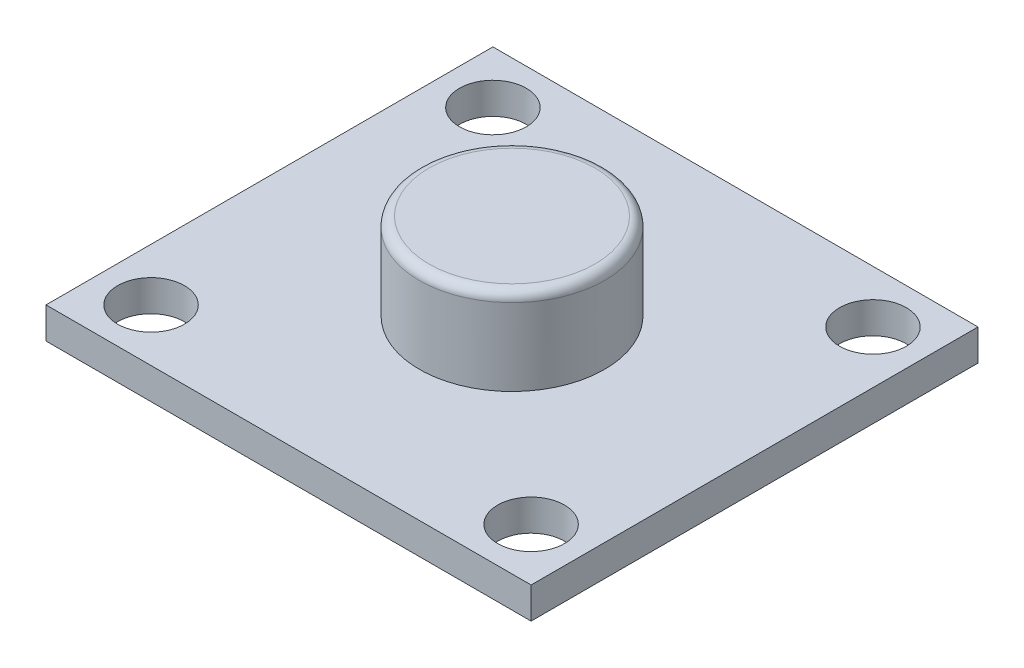
ISO-10303-21;
HEADER;
FILE_DESCRIPTION(('STEP AP214'),'2;1');
FILE_NAME('part.step','',(''),(''),'','','');
FILE_SCHEMA(('AUTOMOTIVE_DESIGN { 1 0 10303 214 1 1 1 1 }'));
ENDSEC;
DATA;
#1=APPLICATION_CONTEXT('core data for automotive mechanical design processes');
#2=APPLICATION_PROTOCOL_DEFINITION('international standard','automotive_design',2000,#1);
#3=PRODUCT_CONTEXT('',#1,'mechanical');
#4=PRODUCT('Part','Part','',(#3));
#5=PRODUCT_RELATED_PRODUCT_CATEGORY('part','',(#4));
#6=PRODUCT_DEFINITION_FORMATION('','',#4);
#7=PRODUCT_DEFINITION_CONTEXT('part definition',#1,'design');
#8=PRODUCT_DEFINITION('design','',#6,#7);
#9=PRODUCT_DEFINITION_SHAPE('','',#8);
#10=(LENGTH_UNIT() NAMED_UNIT(*) SI_UNIT(.MILLI.,.METRE.));
#11=(NAMED_UNIT(*) PLANE_ANGLE_UNIT() SI_UNIT($,.RADIAN.));
#12=(NAMED_UNIT(*) SI_UNIT($,.STERADIAN.) SOLID_ANGLE_UNIT());
#13=UNCERTAINTY_MEASURE_WITH_UNIT(LENGTH_MEASURE(1.E-05),#10,'distance_accuracy_value','');
#14=(GEOMETRIC_REPRESENTATION_CONTEXT(3) GLOBAL_UNCERTAINTY_ASSIGNED_CONTEXT((#13)) GLOBAL_UNIT_ASSIGNED_CONTEXT((#10,
#11,#12)) REPRESENTATION_CONTEXT('',''));
#15=CARTESIAN_POINT('',(0.,0.,0.));
#16=DIRECTION('',(0.,0.,1.));
#17=DIRECTION('',(1.,0.,0.));
#18=AXIS2_PLACEMENT_3D('',#15,#16,#17);
#19=CARTESIAN_POINT('',(0.,5.67,0.));
#20=DIRECTION('',(0.,1.,0.));
#21=DIRECTION('',(0.,0.,1.));
#22=AXIS2_PLACEMENT_3D('',#19,#20,#21);
#23=TOROIDAL_SURFACE('',#22,4.35,0.5);
#24=CARTESIAN_POINT('',(0.,6.17,0.));
#25=DIRECTION('',(0.,1.,0.));
#26=DIRECTION('',(0.,0.,1.));
#27=AXIS2_PLACEMENT_3D('',#24,#25,#26);
#28=CIRCLE('',#27,4.35);
#29=CARTESIAN_POINT('',(0.,6.17,4.35));
#30=VERTEX_POINT('',#29);
#31=EDGE_CURVE('E58',#30,#30,#28,.T.);
#32=ORIENTED_EDGE('',*,*,#31,.F.);
#33=EDGE_LOOP('',(#32));
#34=FACE_BOUND('',#33,.T.);
#35=CARTESIAN_POINT('',(0.,5.67,0.));
#36=DIRECTION('',(0.,1.,0.));
#37=DIRECTION('',(0.,0.,1.));
#38=AXIS2_PLACEMENT_3D('',#35,#36,#37);
#39=CIRCLE('',#38,4.85);
#40=CARTESIAN_POINT('',(0.,5.67,4.85));
#41=VERTEX_POINT('',#40);
#42=EDGE_CURVE('E13',#41,#41,#39,.F.);
#43=ORIENTED_EDGE('',*,*,#42,.F.);
#44=EDGE_LOOP('',(#43));
#45=FACE_BOUND('',#44,.T.);
#46=ADVANCED_FACE('F50',(#34,#45),#23,.T.);
#47=CARTESIAN_POINT('',(12.7,1.64,11.7));
#48=DIRECTION('',(-1.,0.,0.));
#49=DIRECTION('',(0.,0.,1.));
#50=AXIS2_PLACEMENT_3D('',#47,#48,#49);
#51=PLANE('',#50);
#52=DIRECTION('',(0.,0.,-1.));
#53=VECTOR('',#52,1.);
#54=CARTESIAN_POINT('',(12.7,0.,11.7));
#55=LINE('',#54,#53);
#56=CARTESIAN_POINT('',(12.7,0.,11.7));
#57=VERTEX_POINT('',#56);
#58=CARTESIAN_POINT('',(12.7,0.,-11.7));
#59=VERTEX_POINT('',#58);
#60=EDGE_CURVE('E117',#57,#59,#55,.T.);
#61=ORIENTED_EDGE('',*,*,#60,.T.);
#62=DIRECTION('',(0.,-1.,0.));
#63=VECTOR('',#62,1.);
#64=CARTESIAN_POINT('',(12.7,1.64,-11.7));
#65=LINE('',#64,#63);
#66=CARTESIAN_POINT('',(12.7,1.64,-11.7));
#67=VERTEX_POINT('',#66);
#68=EDGE_CURVE('E108',#67,#59,#65,.T.);
#69=ORIENTED_EDGE('',*,*,#68,.F.);
#70=DIRECTION('',(0.,0.,-1.));
#71=VECTOR('',#70,1.);
#72=CARTESIAN_POINT('',(12.7,1.64,11.7));
#73=LINE('',#72,#71);
#74=CARTESIAN_POINT('',(12.7,1.64,11.7));
#75=VERTEX_POINT('',#74);
#76=EDGE_CURVE('E102',#75,#67,#73,.T.);
#77=ORIENTED_EDGE('',*,*,#76,.F.);
#78=DIRECTION('',(0.,-1.,0.));
#79=VECTOR('',#78,1.);
#80=CARTESIAN_POINT('',(12.7,1.64,11.7));
#81=LINE('',#80,#79);
#82=EDGE_CURVE('E113',#75,#57,#81,.T.);
#83=ORIENTED_EDGE('',*,*,#82,.T.);
#84=EDGE_LOOP('',(#61,#69,#77,#83));
#85=FACE_BOUND('',#84,.T.);
#86=ADVANCED_FACE('F136',(#85),#51,.F.);
#87=CARTESIAN_POINT('',(-12.7,1.64,-11.7));
#88=DIRECTION('',(0.,0.,1.));
#89=DIRECTION('',(1.,0.,0.));
#90=AXIS2_PLACEMENT_3D('',#87,#88,#89);
#91=PLANE('',#90);
#92=DIRECTION('',(-1.,0.,0.));
#93=VECTOR('',#92,1.);
#94=CARTESIAN_POINT('',(-12.7,0.,-11.7));
#95=LINE('',#94,#93);
#96=CARTESIAN_POINT('',(-12.7,0.,-11.7));
#97=VERTEX_POINT('',#96);
#98=EDGE_CURVE('E107',#59,#97,#95,.T.);
#99=ORIENTED_EDGE('',*,*,#98,.T.);
#100=DIRECTION('',(0.,-1.,0.));
#101=VECTOR('',#100,1.);
#102=CARTESIAN_POINT('',(-12.7,1.64,-11.7));
#103=LINE('',#102,#101);
#104=CARTESIAN_POINT('',(-12.7,1.64,-11.7));
#105=VERTEX_POINT('',#104);
#106=EDGE_CURVE('E105',#105,#97,#103,.T.);
#107=ORIENTED_EDGE('',*,*,#106,.F.);
#108=DIRECTION('',(-1.,0.,0.));
#109=VECTOR('',#108,1.);
#110=CARTESIAN_POINT('',(-12.7,1.64,-11.7));
#111=LINE('',#110,#109);
#112=EDGE_CURVE('E97',#67,#105,#111,.T.);
#113=ORIENTED_EDGE('',*,*,#112,.F.);
#114=ORIENTED_EDGE('',*,*,#68,.T.);
#115=EDGE_LOOP('',(#99,#107,#113,#114));
#116=FACE_BOUND('',#115,.T.);
#117=ADVANCED_FACE('F106',(#116),#91,.F.);
#118=CARTESIAN_POINT('',(-12.7,1.64,11.7));
#119=DIRECTION('',(1.,0.,0.));
#120=DIRECTION('',(0.,0.,-1.));
#121=AXIS2_PLACEMENT_3D('',#118,#119,#120);
#122=PLANE('',#121);
#123=DIRECTION('',(0.,0.,1.));
#124=VECTOR('',#123,1.);
#125=CARTESIAN_POINT('',(-12.7,0.,11.7));
#126=LINE('',#125,#124);
#127=CARTESIAN_POINT('',(-12.7,0.,11.7));
#128=VERTEX_POINT('',#127);
#129=EDGE_CURVE('E83',#97,#128,#126,.T.);
#130=ORIENTED_EDGE('',*,*,#129,.T.);
#131=DIRECTION('',(0.,-1.,0.));
#132=VECTOR('',#131,1.);
#133=CARTESIAN_POINT('',(-12.7,1.64,11.7));
#134=LINE('',#133,#132);
#135=CARTESIAN_POINT('',(-12.7,1.64,11.7));
#136=VERTEX_POINT('',#135);
#137=EDGE_CURVE('E109',#136,#128,#134,.T.);
#138=ORIENTED_EDGE('',*,*,#137,.F.);
#139=DIRECTION('',(0.,0.,1.));
#140=VECTOR('',#139,1.);
#141=CARTESIAN_POINT('',(-12.7,1.64,11.7));
#142=LINE('',#141,#140);
#143=EDGE_CURVE('E100',#105,#136,#142,.T.);
#144=ORIENTED_EDGE('',*,*,#143,.F.);
#145=ORIENTED_EDGE('',*,*,#106,.T.);
#146=EDGE_LOOP('',(#130,#138,#144,#145));
#147=FACE_BOUND('',#146,.T.);
#148=ADVANCED_FACE('F111',(#147),#122,.F.);
#149=CARTESIAN_POINT('',(-12.7,1.64,11.7));
#150=DIRECTION('',(0.,0.,-1.));
#151=DIRECTION('',(-1.,0.,0.));
#152=AXIS2_PLACEMENT_3D('',#149,#150,#151);
#153=PLANE('',#152);
#154=DIRECTION('',(1.,0.,0.));
#155=VECTOR('',#154,1.);
#156=CARTESIAN_POINT('',(-12.7,0.,11.7));
#157=LINE('',#156,#155);
#158=EDGE_CURVE('E89',#128,#57,#157,.T.);
#159=ORIENTED_EDGE('',*,*,#158,.T.);
#160=ORIENTED_EDGE('',*,*,#82,.F.);
#161=DIRECTION('',(1.,0.,0.));
#162=VECTOR('',#161,1.);
#163=CARTESIAN_POINT('',(-12.7,1.64,11.7));
#164=LINE('',#163,#162);
#165=EDGE_CURVE('E66',#136,#75,#164,.T.);
#166=ORIENTED_EDGE('',*,*,#165,.F.);
#167=ORIENTED_EDGE('',*,*,#137,.T.);
#168=EDGE_LOOP('',(#159,#160,#166,#167));
#169=FACE_BOUND('',#168,.T.);
#170=ADVANCED_FACE('F149',(#169),#153,.F.);
#171=CARTESIAN_POINT('',(0.,1.64,0.));
#172=DIRECTION('',(0.,-1.,0.));
#173=DIRECTION('',(0.,0.,-1.));
#174=AXIS2_PLACEMENT_3D('',#171,#172,#173);
#175=PLANE('',#174);
#176=CARTESIAN_POINT('',(0.,1.64,0.));
#177=DIRECTION('',(0.,-1.,0.));
#178=DIRECTION('',(0.,0.,-1.));
#179=AXIS2_PLACEMENT_3D('',#176,#177,#178);
#180=CIRCLE('',#179,4.85);
#181=CARTESIAN_POINT('',(0.,1.64,-4.85));
#182=VERTEX_POINT('',#181);
#183=EDGE_CURVE('E127',#182,#182,#180,.F.);
#184=ORIENTED_EDGE('',*,*,#183,.F.);
#185=EDGE_LOOP('',(#184));
#186=FACE_BOUND('',#185,.T.);
#187=CARTESIAN_POINT('',(-9.95,1.64,-8.95));
#188=DIRECTION('',(0.,1.,0.));
#189=DIRECTION('',(0.,0.,1.));
#190=AXIS2_PLACEMENT_3D('',#187,#188,#189);
#191=CIRCLE('',#190,1.75);
#192=CARTESIAN_POINT('',(-9.95,1.64,-7.2));
#193=VERTEX_POINT('',#192);
#194=EDGE_CURVE('E154',#193,#193,#191,.T.);
#195=ORIENTED_EDGE('',*,*,#194,.F.);
#196=EDGE_LOOP('',(#195));
#197=FACE_BOUND('',#196,.T.);
#198=CARTESIAN_POINT('',(9.95,1.64,-8.95));
#199=DIRECTION('',(0.,1.,0.));
#200=DIRECTION('',(0.,0.,1.));
#201=AXIS2_PLACEMENT_3D('',#198,#199,#200);
#202=CIRCLE('',#201,1.75);
#203=CARTESIAN_POINT('',(9.95,1.64,-7.2));
#204=VERTEX_POINT('',#203);
#205=EDGE_CURVE('E158',#204,#204,#202,.T.);
#206=ORIENTED_EDGE('',*,*,#205,.F.);
#207=EDGE_LOOP('',(#206));
#208=FACE_BOUND('',#207,.T.);
#209=CARTESIAN_POINT('',(9.95,1.64,8.95));
#210=DIRECTION('',(0.,1.,0.));
#211=DIRECTION('',(0.,0.,1.));
#212=AXIS2_PLACEMENT_3D('',#209,#210,#211);
#213=CIRCLE('',#212,1.75);
#214=CARTESIAN_POINT('',(9.95,1.64,10.7));
#215=VERTEX_POINT('',#214);
#216=EDGE_CURVE('E162',#215,#215,#213,.T.);
#217=ORIENTED_EDGE('',*,*,#216,.F.);
#218=EDGE_LOOP('',(#217));
#219=FACE_BOUND('',#218,.T.);
#220=CARTESIAN_POINT('',(-9.95,1.64,8.95));
#221=DIRECTION('',(0.,1.,0.));
#222=DIRECTION('',(0.,0.,1.));
#223=AXIS2_PLACEMENT_3D('',#220,#221,#222);
#224=CIRCLE('',#223,1.75);
#225=CARTESIAN_POINT('',(-9.95,1.64,10.7));
#226=VERTEX_POINT('',#225);
#227=EDGE_CURVE('E165',#226,#226,#224,.T.);
#228=ORIENTED_EDGE('',*,*,#227,.F.);
#229=EDGE_LOOP('',(#228));
#230=FACE_BOUND('',#229,.T.);
#231=ORIENTED_EDGE('',*,*,#76,.T.);
#232=ORIENTED_EDGE('',*,*,#112,.T.);
#233=ORIENTED_EDGE('',*,*,#143,.T.);
#234=ORIENTED_EDGE('',*,*,#165,.T.);
#235=EDGE_LOOP('',(#231,#232,#233,#234));
#236=FACE_BOUND('',#235,.T.);
#237=ADVANCED_FACE('F98',(#186,#197,#208,#219,#230,#236),#175,.F.);
#238=CARTESIAN_POINT('',(0.,0.,0.));
#239=DIRECTION('',(0.,-1.,0.));
#240=DIRECTION('',(0.,0.,-1.));
#241=AXIS2_PLACEMENT_3D('',#238,#239,#240);
#242=PLANE('',#241);
#243=CARTESIAN_POINT('',(-9.95,0.,-8.95));
#244=DIRECTION('',(0.,1.,0.));
#245=DIRECTION('',(0.,0.,1.));
#246=AXIS2_PLACEMENT_3D('',#243,#244,#245);
#247=CIRCLE('',#246,1.75);
#248=CARTESIAN_POINT('',(-9.95,0.,-7.2));
#249=VERTEX_POINT('',#248);
#250=EDGE_CURVE('E175',#249,#249,#247,.T.);
#251=ORIENTED_EDGE('',*,*,#250,.T.);
#252=EDGE_LOOP('',(#251));
#253=FACE_BOUND('',#252,.T.);
#254=CARTESIAN_POINT('',(9.95,0.,-8.95));
#255=DIRECTION('',(0.,1.,0.));
#256=DIRECTION('',(0.,0.,1.));
#257=AXIS2_PLACEMENT_3D('',#254,#255,#256);
#258=CIRCLE('',#257,1.75);
#259=CARTESIAN_POINT('',(9.95,0.,-7.2));
#260=VERTEX_POINT('',#259);
#261=EDGE_CURVE('E179',#260,#260,#258,.T.);
#262=ORIENTED_EDGE('',*,*,#261,.T.);
#263=EDGE_LOOP('',(#262));
#264=FACE_BOUND('',#263,.T.);
#265=CARTESIAN_POINT('',(9.95,0.,8.95));
#266=DIRECTION('',(0.,1.,0.));
#267=DIRECTION('',(0.,0.,1.));
#268=AXIS2_PLACEMENT_3D('',#265,#266,#267);
#269=CIRCLE('',#268,1.75);
#270=CARTESIAN_POINT('',(9.95,0.,10.7));
#271=VERTEX_POINT('',#270);
#272=EDGE_CURVE('E167',#271,#271,#269,.T.);
#273=ORIENTED_EDGE('',*,*,#272,.T.);
#274=EDGE_LOOP('',(#273));
#275=FACE_BOUND('',#274,.T.);
#276=CARTESIAN_POINT('',(-9.95,0.,8.95));
#277=DIRECTION('',(0.,1.,0.));
#278=DIRECTION('',(0.,0.,1.));
#279=AXIS2_PLACEMENT_3D('',#276,#277,#278);
#280=CIRCLE('',#279,1.75);
#281=CARTESIAN_POINT('',(-9.95,0.,10.7));
#282=VERTEX_POINT('',#281);
#283=EDGE_CURVE('E120',#282,#282,#280,.T.);
#284=ORIENTED_EDGE('',*,*,#283,.T.);
#285=EDGE_LOOP('',(#284));
#286=FACE_BOUND('',#285,.T.);
#287=ORIENTED_EDGE('',*,*,#60,.F.);
#288=ORIENTED_EDGE('',*,*,#158,.F.);
#289=ORIENTED_EDGE('',*,*,#129,.F.);
#290=ORIENTED_EDGE('',*,*,#98,.F.);
#291=EDGE_LOOP('',(#287,#288,#289,#290));
#292=FACE_BOUND('',#291,.T.);
#293=ADVANCED_FACE('F148',(#253,#264,#275,#286,#292),#242,.T.);
#294=CARTESIAN_POINT('',(-9.95,0.,8.95));
#295=DIRECTION('',(0.,1.,0.));
#296=DIRECTION('',(0.,0.,1.));
#297=AXIS2_PLACEMENT_3D('',#294,#295,#296);
#298=CYLINDRICAL_SURFACE('',#297,1.75);
#299=ORIENTED_EDGE('',*,*,#283,.F.);
#300=EDGE_LOOP('',(#299));
#301=FACE_BOUND('',#300,.T.);
#302=ORIENTED_EDGE('',*,*,#227,.T.);
#303=EDGE_LOOP('',(#302));
#304=FACE_BOUND('',#303,.T.);
#305=ADVANCED_FACE('F186',(#301,#304),#298,.F.);
#306=CARTESIAN_POINT('',(9.95,0.,8.95));
#307=DIRECTION('',(0.,1.,0.));
#308=DIRECTION('',(0.,0.,1.));
#309=AXIS2_PLACEMENT_3D('',#306,#307,#308);
#310=CYLINDRICAL_SURFACE('',#309,1.75);
#311=ORIENTED_EDGE('',*,*,#272,.F.);
#312=EDGE_LOOP('',(#311));
#313=FACE_BOUND('',#312,.T.);
#314=ORIENTED_EDGE('',*,*,#216,.T.);
#315=EDGE_LOOP('',(#314));
#316=FACE_BOUND('',#315,.T.);
#317=ADVANCED_FACE('F183',(#313,#316),#310,.F.);
#318=CARTESIAN_POINT('',(9.95,0.,-8.95));
#319=DIRECTION('',(0.,1.,0.));
#320=DIRECTION('',(0.,0.,1.));
#321=AXIS2_PLACEMENT_3D('',#318,#319,#320);
#322=CYLINDRICAL_SURFACE('',#321,1.75);
#323=ORIENTED_EDGE('',*,*,#261,.F.);
#324=EDGE_LOOP('',(#323));
#325=FACE_BOUND('',#324,.T.);
#326=ORIENTED_EDGE('',*,*,#205,.T.);
#327=EDGE_LOOP('',(#326));
#328=FACE_BOUND('',#327,.T.);
#329=ADVANCED_FACE('F185',(#325,#328),#322,.F.);
#330=CARTESIAN_POINT('',(-9.95,0.,-8.95));
#331=DIRECTION('',(0.,1.,0.));
#332=DIRECTION('',(0.,0.,1.));
#333=AXIS2_PLACEMENT_3D('',#330,#331,#332);
#334=CYLINDRICAL_SURFACE('',#333,1.75);
#335=ORIENTED_EDGE('',*,*,#250,.F.);
#336=EDGE_LOOP('',(#335));
#337=FACE_BOUND('',#336,.T.);
#338=ORIENTED_EDGE('',*,*,#194,.T.);
#339=EDGE_LOOP('',(#338));
#340=FACE_BOUND('',#339,.T.);
#341=ADVANCED_FACE('F142',(#337,#340),#334,.F.);
#342=CARTESIAN_POINT('',(0.,6.17,0.));
#343=DIRECTION('',(0.,-1.,0.));
#344=DIRECTION('',(0.,0.,-1.));
#345=AXIS2_PLACEMENT_3D('',#342,#343,#344);
#346=CYLINDRICAL_SURFACE('',#345,4.85);
#347=ORIENTED_EDGE('',*,*,#42,.T.);
#348=EDGE_LOOP('',(#347));
#349=FACE_BOUND('',#348,.T.);
#350=ORIENTED_EDGE('',*,*,#183,.T.);
#351=EDGE_LOOP('',(#350));
#352=FACE_BOUND('',#351,.T.);
#353=ADVANCED_FACE('F139',(#349,#352),#346,.T.);
#354=CARTESIAN_POINT('',(0.,6.17,0.));
#355=DIRECTION('',(0.,1.,0.));
#356=DIRECTION('',(0.,0.,1.));
#357=AXIS2_PLACEMENT_3D('',#354,#355,#356);
#358=PLANE('',#357);
#359=ORIENTED_EDGE('',*,*,#31,.T.);
#360=EDGE_LOOP('',(#359));
#361=FACE_BOUND('',#360,.T.);
#362=ADVANCED_FACE('F132',(#361),#358,.T.);
#363=CLOSED_SHELL('',(#46,#86,#117,#148,#170,#237,#293,#305,#317,#329,#341,#353,#362));
#364=MANIFOLD_SOLID_BREP('B2',#363);
#365=ADVANCED_BREP_SHAPE_REPRESENTATION('',(#18,#364),#14);
#366=SHAPE_DEFINITION_REPRESENTATION(#9,#365);
ENDSEC;
END-ISO-10303-21;
